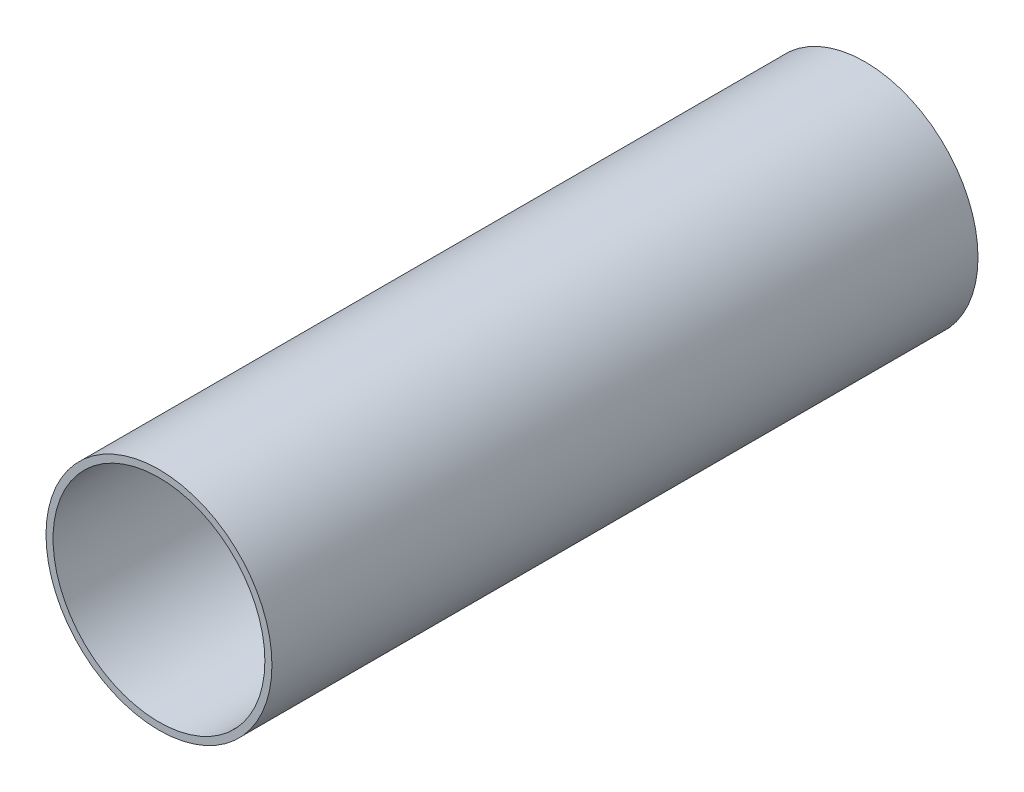
ISO-10303-21;
HEADER;
FILE_DESCRIPTION(('STEP AP214'),'2;1');
FILE_NAME('part.step','',(''),(''),'','','');
FILE_SCHEMA(('AUTOMOTIVE_DESIGN { 1 0 10303 214 1 1 1 1 }'));
ENDSEC;
DATA;
#1=APPLICATION_CONTEXT('core data for automotive mechanical design processes');
#2=APPLICATION_PROTOCOL_DEFINITION('international standard','automotive_design',2000,#1);
#3=PRODUCT_CONTEXT('',#1,'mechanical');
#4=PRODUCT('Part','Part','',(#3));
#5=PRODUCT_RELATED_PRODUCT_CATEGORY('part','',(#4));
#6=PRODUCT_DEFINITION_FORMATION('','',#4);
#7=PRODUCT_DEFINITION_CONTEXT('part definition',#1,'design');
#8=PRODUCT_DEFINITION('design','',#6,#7);
#9=PRODUCT_DEFINITION_SHAPE('','',#8);
#10=(LENGTH_UNIT() NAMED_UNIT(*) SI_UNIT(.MILLI.,.METRE.));
#11=(NAMED_UNIT(*) PLANE_ANGLE_UNIT() SI_UNIT($,.RADIAN.));
#12=(NAMED_UNIT(*) SI_UNIT($,.STERADIAN.) SOLID_ANGLE_UNIT());
#13=UNCERTAINTY_MEASURE_WITH_UNIT(LENGTH_MEASURE(1.E-05),#10,'distance_accuracy_value','');
#14=(GEOMETRIC_REPRESENTATION_CONTEXT(3) GLOBAL_UNCERTAINTY_ASSIGNED_CONTEXT((#13)) GLOBAL_UNIT_ASSIGNED_CONTEXT((#10,
#11,#12)) REPRESENTATION_CONTEXT('',''));
#15=CARTESIAN_POINT('',(0.,0.,0.));
#16=DIRECTION('',(0.,0.,1.));
#17=DIRECTION('',(1.,0.,0.));
#18=AXIS2_PLACEMENT_3D('',#15,#16,#17);
#19=CARTESIAN_POINT('',(0.,0.,200.));
#20=DIRECTION('',(0.,0.,1.));
#21=DIRECTION('',(1.,0.,0.));
#22=AXIS2_PLACEMENT_3D('',#19,#20,#21);
#23=PLANE('',#22);
#24=CARTESIAN_POINT('',(0.,0.,200.));
#25=DIRECTION('',(0.,0.,1.));
#26=DIRECTION('',(1.,0.,0.));
#27=AXIS2_PLACEMENT_3D('',#24,#25,#26);
#28=CIRCLE('',#27,32.);
#29=CARTESIAN_POINT('',(32.,0.,200.));
#30=VERTEX_POINT('',#29);
#31=EDGE_CURVE('E10',#30,#30,#28,.T.);
#32=ORIENTED_EDGE('',*,*,#31,.T.);
#33=EDGE_LOOP('',(#32));
#34=FACE_BOUND('',#33,.T.);
#35=CARTESIAN_POINT('',(0.,0.,200.));
#36=DIRECTION('',(0.,0.,1.));
#37=DIRECTION('',(1.,0.,0.));
#38=AXIS2_PLACEMENT_3D('',#35,#36,#37);
#39=CIRCLE('',#38,30.);
#40=CARTESIAN_POINT('',(30.,0.,200.));
#41=VERTEX_POINT('',#40);
#42=EDGE_CURVE('E52',#41,#41,#39,.T.);
#43=ORIENTED_EDGE('',*,*,#42,.F.);
#44=EDGE_LOOP('',(#43));
#45=FACE_BOUND('',#44,.T.);
#46=ADVANCED_FACE('F41',(#34,#45),#23,.T.);
#47=CARTESIAN_POINT('',(0.,0.,0.));
#48=DIRECTION('',(0.,0.,1.));
#49=DIRECTION('',(1.,0.,0.));
#50=AXIS2_PLACEMENT_3D('',#47,#48,#49);
#51=PLANE('',#50);
#52=CARTESIAN_POINT('',(0.,0.,0.));
#53=DIRECTION('',(0.,0.,1.));
#54=DIRECTION('',(1.,0.,0.));
#55=AXIS2_PLACEMENT_3D('',#52,#53,#54);
#56=CIRCLE('',#55,32.);
#57=CARTESIAN_POINT('',(32.,0.,0.));
#58=VERTEX_POINT('',#57);
#59=EDGE_CURVE('E45',#58,#58,#56,.T.);
#60=ORIENTED_EDGE('',*,*,#59,.F.);
#61=EDGE_LOOP('',(#60));
#62=FACE_BOUND('',#61,.T.);
#63=CARTESIAN_POINT('',(0.,0.,0.));
#64=DIRECTION('',(0.,0.,1.));
#65=DIRECTION('',(1.,0.,0.));
#66=AXIS2_PLACEMENT_3D('',#63,#64,#65);
#67=CIRCLE('',#66,30.);
#68=CARTESIAN_POINT('',(30.,0.,0.));
#69=VERTEX_POINT('',#68);
#70=EDGE_CURVE('E54',#69,#69,#67,.T.);
#71=ORIENTED_EDGE('',*,*,#70,.T.);
#72=EDGE_LOOP('',(#71));
#73=FACE_BOUND('',#72,.T.);
#74=ADVANCED_FACE('F64',(#62,#73),#51,.F.);
#75=CARTESIAN_POINT('',(0.,0.,200.));
#76=DIRECTION('',(0.,0.,-1.));
#77=DIRECTION('',(-1.,0.,0.));
#78=AXIS2_PLACEMENT_3D('',#75,#76,#77);
#79=CYLINDRICAL_SURFACE('',#78,32.);
#80=ORIENTED_EDGE('',*,*,#31,.F.);
#81=EDGE_LOOP('',(#80));
#82=FACE_BOUND('',#81,.T.);
#83=ORIENTED_EDGE('',*,*,#59,.T.);
#84=EDGE_LOOP('',(#83));
#85=FACE_BOUND('',#84,.T.);
#86=ADVANCED_FACE('F43',(#82,#85),#79,.T.);
#87=CARTESIAN_POINT('',(0.,0.,200.));
#88=DIRECTION('',(0.,0.,-1.));
#89=DIRECTION('',(-1.,0.,0.));
#90=AXIS2_PLACEMENT_3D('',#87,#88,#89);
#91=CYLINDRICAL_SURFACE('',#90,30.);
#92=ORIENTED_EDGE('',*,*,#42,.T.);
#93=EDGE_LOOP('',(#92));
#94=FACE_BOUND('',#93,.T.);
#95=ORIENTED_EDGE('',*,*,#70,.F.);
#96=EDGE_LOOP('',(#95));
#97=FACE_BOUND('',#96,.T.);
#98=ADVANCED_FACE('F60',(#94,#97),#91,.F.);
#99=CLOSED_SHELL('',(#46,#74,#86,#98));
#100=MANIFOLD_SOLID_BREP('B2',#99);
#101=ADVANCED_BREP_SHAPE_REPRESENTATION('',(#18,#100),#14);
#102=SHAPE_DEFINITION_REPRESENTATION(#9,#101);
ENDSEC;
END-ISO-10303-21;
